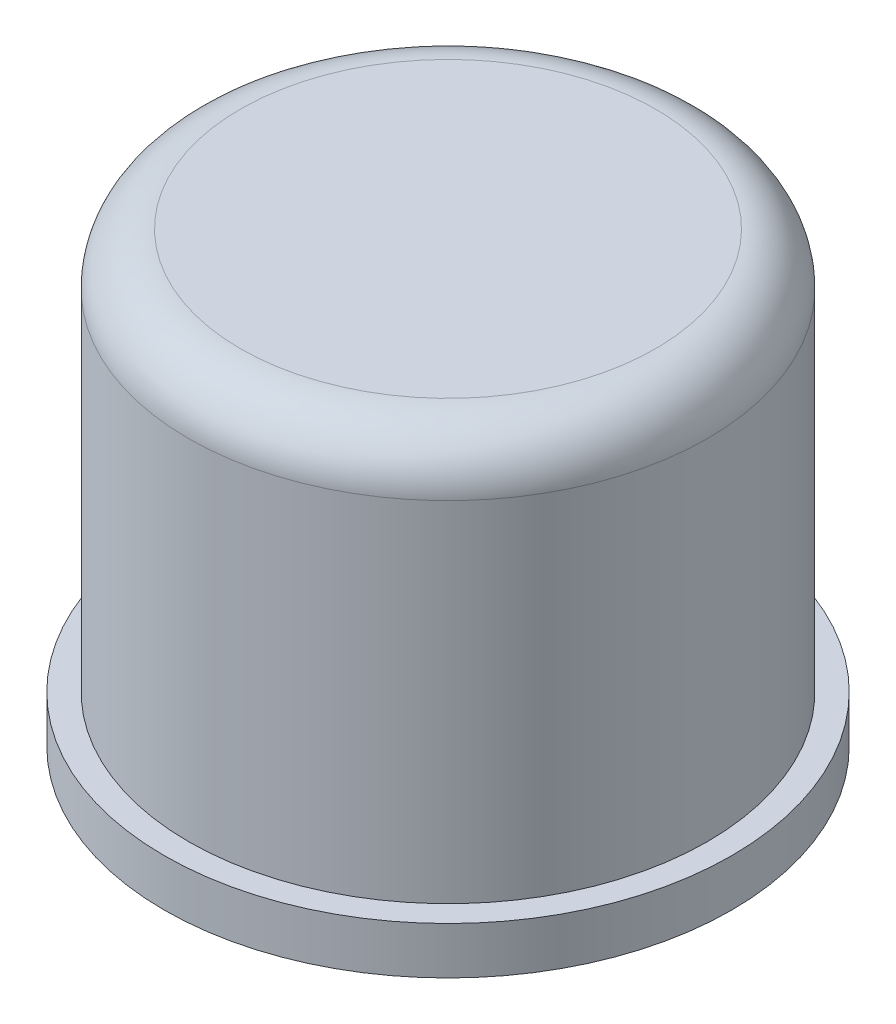
ISO-10303-21;
HEADER;
FILE_DESCRIPTION(('STEP AP214'),'2;1');
FILE_NAME('part.step','',(''),(''),'','','');
FILE_SCHEMA(('AUTOMOTIVE_DESIGN { 1 0 10303 214 1 1 1 1 }'));
ENDSEC;
DATA;
#1=APPLICATION_CONTEXT('core data for automotive mechanical design processes');
#2=APPLICATION_PROTOCOL_DEFINITION('international standard','automotive_design',2000,#1);
#3=PRODUCT_CONTEXT('',#1,'mechanical');
#4=PRODUCT('Part','Part','',(#3));
#5=PRODUCT_RELATED_PRODUCT_CATEGORY('part','',(#4));
#6=PRODUCT_DEFINITION_FORMATION('','',#4);
#7=PRODUCT_DEFINITION_CONTEXT('part definition',#1,'design');
#8=PRODUCT_DEFINITION('design','',#6,#7);
#9=PRODUCT_DEFINITION_SHAPE('','',#8);
#10=(LENGTH_UNIT() NAMED_UNIT(*) SI_UNIT(.MILLI.,.METRE.));
#11=(NAMED_UNIT(*) PLANE_ANGLE_UNIT() SI_UNIT($,.RADIAN.));
#12=(NAMED_UNIT(*) SI_UNIT($,.STERADIAN.) SOLID_ANGLE_UNIT());
#13=UNCERTAINTY_MEASURE_WITH_UNIT(LENGTH_MEASURE(1.E-05),#10,'distance_accuracy_value','');
#14=(GEOMETRIC_REPRESENTATION_CONTEXT(3) GLOBAL_UNCERTAINTY_ASSIGNED_CONTEXT((#13)) GLOBAL_UNIT_ASSIGNED_CONTEXT((#10,
#11,#12)) REPRESENTATION_CONTEXT('',''));
#15=CARTESIAN_POINT('',(0.,0.,0.));
#16=DIRECTION('',(0.,0.,1.));
#17=DIRECTION('',(1.,0.,0.));
#18=AXIS2_PLACEMENT_3D('',#15,#16,#17);
#19=CARTESIAN_POINT('',(0.,1700.,0.));
#20=DIRECTION('',(0.,-1.,0.));
#21=DIRECTION('',(0.,0.,-1.));
#22=AXIS2_PLACEMENT_3D('',#19,#20,#21);
#23=CYLINDRICAL_SURFACE('',#22,1100.);
#24=CARTESIAN_POINT('',(0.,1480.,0.));
#25=DIRECTION('',(0.,1.,0.));
#26=DIRECTION('',(0.,0.,1.));
#27=AXIS2_PLACEMENT_3D('',#24,#25,#26);
#28=CIRCLE('',#27,1100.);
#29=CARTESIAN_POINT('',(0.,1480.,1100.));
#30=VERTEX_POINT('',#29);
#31=EDGE_CURVE('E10',#30,#30,#28,.F.);
#32=ORIENTED_EDGE('',*,*,#31,.T.);
#33=EDGE_LOOP('',(#32));
#34=FACE_BOUND('',#33,.T.);
#35=CARTESIAN_POINT('',(0.,0.,0.));
#36=DIRECTION('',(0.,1.,0.));
#37=DIRECTION('',(0.,0.,1.));
#38=AXIS2_PLACEMENT_3D('',#35,#36,#37);
#39=CIRCLE('',#38,1100.);
#40=CARTESIAN_POINT('',(0.,0.,1100.));
#41=VERTEX_POINT('',#40);
#42=EDGE_CURVE('E54',#41,#41,#39,.T.);
#43=ORIENTED_EDGE('',*,*,#42,.T.);
#44=EDGE_LOOP('',(#43));
#45=FACE_BOUND('',#44,.T.);
#46=ADVANCED_FACE('F41',(#34,#45),#23,.T.);
#47=CARTESIAN_POINT('',(0.,1700.,0.));
#48=DIRECTION('',(0.,1.,0.));
#49=DIRECTION('',(0.,0.,1.));
#50=AXIS2_PLACEMENT_3D('',#47,#48,#49);
#51=PLANE('',#50);
#52=CARTESIAN_POINT('',(0.,1700.,0.));
#53=DIRECTION('',(0.,1.,0.));
#54=DIRECTION('',(0.,0.,1.));
#55=AXIS2_PLACEMENT_3D('',#52,#53,#54);
#56=CIRCLE('',#55,880.);
#57=CARTESIAN_POINT('',(0.,1700.,880.));
#58=VERTEX_POINT('',#57);
#59=EDGE_CURVE('E49',#58,#58,#56,.T.);
#60=ORIENTED_EDGE('',*,*,#59,.T.);
#61=EDGE_LOOP('',(#60));
#62=FACE_BOUND('',#61,.T.);
#63=ADVANCED_FACE('F88',(#62),#51,.T.);
#64=CARTESIAN_POINT('',(0.,1480.,0.));
#65=DIRECTION('',(0.,1.,0.));
#66=DIRECTION('',(0.,0.,1.));
#67=AXIS2_PLACEMENT_3D('',#64,#65,#66);
#68=TOROIDAL_SURFACE('',#67,880.,220.);
#69=ORIENTED_EDGE('',*,*,#31,.F.);
#70=EDGE_LOOP('',(#69));
#71=FACE_BOUND('',#70,.T.);
#72=ORIENTED_EDGE('',*,*,#59,.F.);
#73=EDGE_LOOP('',(#72));
#74=FACE_BOUND('',#73,.T.);
#75=ADVANCED_FACE('F43',(#71,#74),#68,.T.);
#76=CARTESIAN_POINT('',(0.,-200.,0.));
#77=DIRECTION('',(0.,1.,0.));
#78=DIRECTION('',(0.,0.,1.));
#79=AXIS2_PLACEMENT_3D('',#76,#77,#78);
#80=CYLINDRICAL_SURFACE('',#79,1202.88976650818);
#81=CARTESIAN_POINT('',(0.,-200.,0.));
#82=DIRECTION('',(0.,-1.,0.));
#83=DIRECTION('',(0.,0.,-1.));
#84=AXIS2_PLACEMENT_3D('',#81,#82,#83);
#85=CIRCLE('',#84,1202.88976650818);
#86=CARTESIAN_POINT('',(0.,-200.,-1202.88976650818));
#87=VERTEX_POINT('',#86);
#88=EDGE_CURVE('E59',#87,#87,#85,.T.);
#89=ORIENTED_EDGE('',*,*,#88,.F.);
#90=EDGE_LOOP('',(#89));
#91=FACE_BOUND('',#90,.T.);
#92=CARTESIAN_POINT('',(0.,0.,0.));
#93=DIRECTION('',(0.,-1.,0.));
#94=DIRECTION('',(0.,0.,-1.));
#95=AXIS2_PLACEMENT_3D('',#92,#93,#94);
#96=CIRCLE('',#95,1202.88976650818);
#97=CARTESIAN_POINT('',(0.,0.,-1202.88976650818));
#98=VERTEX_POINT('',#97);
#99=EDGE_CURVE('E62',#98,#98,#96,.T.);
#100=ORIENTED_EDGE('',*,*,#99,.T.);
#101=EDGE_LOOP('',(#100));
#102=FACE_BOUND('',#101,.T.);
#103=ADVANCED_FACE('F72',(#91,#102),#80,.T.);
#104=CARTESIAN_POINT('',(0.,-200.,0.));
#105=DIRECTION('',(0.,-1.,0.));
#106=DIRECTION('',(0.,0.,-1.));
#107=AXIS2_PLACEMENT_3D('',#104,#105,#106);
#108=PLANE('',#107);
#109=ORIENTED_EDGE('',*,*,#88,.T.);
#110=EDGE_LOOP('',(#109));
#111=FACE_BOUND('',#110,.T.);
#112=ADVANCED_FACE('F70',(#111),#108,.T.);
#113=CARTESIAN_POINT('',(0.,0.,0.));
#114=DIRECTION('',(0.,-1.,0.));
#115=DIRECTION('',(0.,0.,-1.));
#116=AXIS2_PLACEMENT_3D('',#113,#114,#115);
#117=PLANE('',#116);
#118=ORIENTED_EDGE('',*,*,#42,.F.);
#119=EDGE_LOOP('',(#118));
#120=FACE_BOUND('',#119,.T.);
#121=ORIENTED_EDGE('',*,*,#99,.F.);
#122=EDGE_LOOP('',(#121));
#123=FACE_BOUND('',#122,.T.);
#124=ADVANCED_FACE('F78',(#120,#123),#117,.F.);
#125=CLOSED_SHELL('',(#46,#63,#75,#103,#112,#124));
#126=MANIFOLD_SOLID_BREP('B2',#125);
#127=ADVANCED_BREP_SHAPE_REPRESENTATION('',(#18,#126),#14);
#128=SHAPE_DEFINITION_REPRESENTATION(#9,#127);
ENDSEC;
END-ISO-10303-21;
